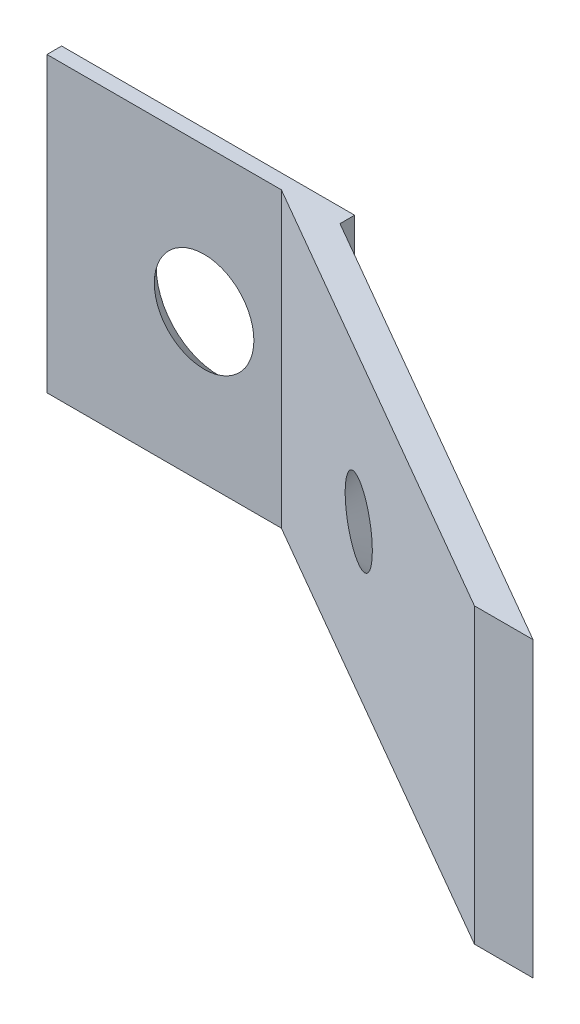
ISO-10303-21;
HEADER;
FILE_DESCRIPTION(('STEP AP214'),'2;1');
FILE_NAME('part.step','',(''),(''),'','','');
FILE_SCHEMA(('AUTOMOTIVE_DESIGN { 1 0 10303 214 1 1 1 1 }'));
ENDSEC;
DATA;
#1=APPLICATION_CONTEXT('core data for automotive mechanical design processes');
#2=APPLICATION_PROTOCOL_DEFINITION('international standard','automotive_design',2000,#1);
#3=PRODUCT_CONTEXT('',#1,'mechanical');
#4=PRODUCT('Part','Part','',(#3));
#5=PRODUCT_RELATED_PRODUCT_CATEGORY('part','',(#4));
#6=PRODUCT_DEFINITION_FORMATION('','',#4);
#7=PRODUCT_DEFINITION_CONTEXT('part definition',#1,'design');
#8=PRODUCT_DEFINITION('design','',#6,#7);
#9=PRODUCT_DEFINITION_SHAPE('','',#8);
#10=(LENGTH_UNIT() NAMED_UNIT(*) SI_UNIT(.MILLI.,.METRE.));
#11=(NAMED_UNIT(*) PLANE_ANGLE_UNIT() SI_UNIT($,.RADIAN.));
#12=(NAMED_UNIT(*) SI_UNIT($,.STERADIAN.) SOLID_ANGLE_UNIT());
#13=UNCERTAINTY_MEASURE_WITH_UNIT(LENGTH_MEASURE(1.E-05),#10,'distance_accuracy_value','');
#14=(GEOMETRIC_REPRESENTATION_CONTEXT(3) GLOBAL_UNCERTAINTY_ASSIGNED_CONTEXT((#13)) GLOBAL_UNIT_ASSIGNED_CONTEXT((#10,
#11,#12)) REPRESENTATION_CONTEXT('',''));
#15=CARTESIAN_POINT('',(0.,0.,0.));
#16=DIRECTION('',(0.,0.,1.));
#17=DIRECTION('',(1.,0.,0.));
#18=AXIS2_PLACEMENT_3D('',#15,#16,#17);
#19=CARTESIAN_POINT('',(0.,0.,0.5));
#20=DIRECTION('',(1.,0.,0.));
#21=DIRECTION('',(0.,1.,0.));
#22=AXIS2_PLACEMENT_3D('',#19,#20,#21);
#23=PLANE('',#22);
#24=DIRECTION('',(0.,-1.,0.));
#25=VECTOR('',#24,1.);
#26=CARTESIAN_POINT('',(0.,0.,0.));
#27=LINE('',#26,#25);
#28=CARTESIAN_POINT('',(0.,0.,0.));
#29=VERTEX_POINT('',#28);
#30=CARTESIAN_POINT('',(0.,-10.,0.));
#31=VERTEX_POINT('',#30);
#32=EDGE_CURVE('E152',#29,#31,#27,.T.);
#33=ORIENTED_EDGE('',*,*,#32,.T.);
#34=DIRECTION('',(0.,0.,-1.));
#35=VECTOR('',#34,1.);
#36=CARTESIAN_POINT('',(0.,-10.,0.5));
#37=LINE('',#36,#35);
#38=CARTESIAN_POINT('',(0.,-10.,0.5));
#39=VERTEX_POINT('',#38);
#40=EDGE_CURVE('E11',#39,#31,#37,.T.);
#41=ORIENTED_EDGE('',*,*,#40,.F.);
#42=DIRECTION('',(0.,-1.,0.));
#43=VECTOR('',#42,1.);
#44=CARTESIAN_POINT('',(0.,0.,0.5));
#45=LINE('',#44,#43);
#46=CARTESIAN_POINT('',(0.,0.,0.5));
#47=VERTEX_POINT('',#46);
#48=EDGE_CURVE('E155',#47,#39,#45,.T.);
#49=ORIENTED_EDGE('',*,*,#48,.F.);
#50=DIRECTION('',(0.,0.,-1.));
#51=VECTOR('',#50,1.);
#52=CARTESIAN_POINT('',(0.,0.,0.5));
#53=LINE('',#52,#51);
#54=EDGE_CURVE('E164',#47,#29,#53,.T.);
#55=ORIENTED_EDGE('',*,*,#54,.T.);
#56=EDGE_LOOP('',(#33,#41,#49,#55));
#57=FACE_BOUND('',#56,.T.);
#58=ADVANCED_FACE('F43',(#57),#23,.F.);
#59=CARTESIAN_POINT('',(0.,-10.,0.5));
#60=DIRECTION('',(0.,1.,0.));
#61=DIRECTION('',(0.,0.,1.));
#62=AXIS2_PLACEMENT_3D('',#59,#60,#61);
#63=PLANE('',#62);
#64=DIRECTION('',(1.,0.,0.));
#65=VECTOR('',#64,1.);
#66=CARTESIAN_POINT('',(0.,-10.,0.));
#67=LINE('',#66,#65);
#68=CARTESIAN_POINT('',(10.,-10.,0.));
#69=VERTEX_POINT('',#68);
#70=EDGE_CURVE('E168',#31,#69,#67,.T.);
#71=ORIENTED_EDGE('',*,*,#70,.T.);
#72=DIRECTION('',(0.,0.,-1.));
#73=VECTOR('',#72,1.);
#74=CARTESIAN_POINT('',(10.,-10.,0.5));
#75=LINE('',#74,#73);
#76=CARTESIAN_POINT('',(10.,-10.,0.5));
#77=VERTEX_POINT('',#76);
#78=EDGE_CURVE('E51',#77,#69,#75,.T.);
#79=ORIENTED_EDGE('',*,*,#78,.F.);
#80=DIRECTION('',(0.866025403784437,0.,0.500000000000002));
#81=VECTOR('',#80,1.);
#82=CARTESIAN_POINT('',(25.5884572681199,-10.,9.50000000000002));
#83=LINE('',#82,#81);
#84=CARTESIAN_POINT('',(25.5884572681199,-10.,9.50000000000002));
#85=VERTEX_POINT('',#84);
#86=EDGE_CURVE('E145',#77,#85,#83,.T.);
#87=ORIENTED_EDGE('',*,*,#86,.T.);
#88=DIRECTION('',(-1.,0.,0.));
#89=VECTOR('',#88,1.);
#90=CARTESIAN_POINT('',(23.5884572681199,-10.,9.50000000000002));
#91=LINE('',#90,#89);
#92=CARTESIAN_POINT('',(23.5884572681199,-10.,9.50000000000002));
#93=VERTEX_POINT('',#92);
#94=EDGE_CURVE('E115',#85,#93,#91,.T.);
#95=ORIENTED_EDGE('',*,*,#94,.T.);
#96=DIRECTION('',(-0.866025403784438,0.,-0.500000000000001));
#97=VECTOR('',#96,1.);
#98=CARTESIAN_POINT('',(8.00000000000001,-10.,0.5));
#99=LINE('',#98,#97);
#100=CARTESIAN_POINT('',(8.00000000000001,-10.,0.5));
#101=VERTEX_POINT('',#100);
#102=EDGE_CURVE('E135',#93,#101,#99,.T.);
#103=ORIENTED_EDGE('',*,*,#102,.T.);
#104=DIRECTION('',(1.,0.,0.));
#105=VECTOR('',#104,1.);
#106=CARTESIAN_POINT('',(0.,-10.,0.5));
#107=LINE('',#106,#105);
#108=EDGE_CURVE('E91',#39,#101,#107,.T.);
#109=ORIENTED_EDGE('',*,*,#108,.F.);
#110=ORIENTED_EDGE('',*,*,#40,.T.);
#111=EDGE_LOOP('',(#71,#79,#87,#95,#103,#109,#110));
#112=FACE_BOUND('',#111,.T.);
#113=ADVANCED_FACE('F194',(#112),#63,.F.);
#114=CARTESIAN_POINT('',(10.,0.,0.5));
#115=DIRECTION('',(-1.,0.,0.));
#116=DIRECTION('',(0.,-1.,0.));
#117=AXIS2_PLACEMENT_3D('',#114,#115,#116);
#118=PLANE('',#117);
#119=DIRECTION('',(0.,1.,0.));
#120=VECTOR('',#119,1.);
#121=CARTESIAN_POINT('',(10.,0.,0.));
#122=LINE('',#121,#120);
#123=CARTESIAN_POINT('',(10.,0.,0.));
#124=VERTEX_POINT('',#123);
#125=EDGE_CURVE('E171',#69,#124,#122,.T.);
#126=ORIENTED_EDGE('',*,*,#125,.T.);
#127=DIRECTION('',(0.,0.,-1.));
#128=VECTOR('',#127,1.);
#129=CARTESIAN_POINT('',(10.,0.,0.5));
#130=LINE('',#129,#128);
#131=CARTESIAN_POINT('',(10.,0.,0.5));
#132=VERTEX_POINT('',#131);
#133=EDGE_CURVE('E178',#132,#124,#130,.T.);
#134=ORIENTED_EDGE('',*,*,#133,.F.);
#135=DIRECTION('',(0.,1.,0.));
#136=VECTOR('',#135,1.);
#137=CARTESIAN_POINT('',(10.,0.,0.5));
#138=LINE('',#137,#136);
#139=EDGE_CURVE('E133',#77,#132,#138,.T.);
#140=ORIENTED_EDGE('',*,*,#139,.F.);
#141=ORIENTED_EDGE('',*,*,#78,.T.);
#142=EDGE_LOOP('',(#126,#134,#140,#141));
#143=FACE_BOUND('',#142,.T.);
#144=ADVANCED_FACE('F184',(#143),#118,.F.);
#145=CARTESIAN_POINT('',(0.,0.,0.5));
#146=DIRECTION('',(0.,-1.,0.));
#147=DIRECTION('',(0.,0.,-1.));
#148=AXIS2_PLACEMENT_3D('',#145,#146,#147);
#149=PLANE('',#148);
#150=DIRECTION('',(-1.,0.,0.));
#151=VECTOR('',#150,1.);
#152=CARTESIAN_POINT('',(0.,0.,0.));
#153=LINE('',#152,#151);
#154=EDGE_CURVE('E85',#124,#29,#153,.T.);
#155=ORIENTED_EDGE('',*,*,#154,.T.);
#156=ORIENTED_EDGE('',*,*,#54,.F.);
#157=DIRECTION('',(-1.,0.,0.));
#158=VECTOR('',#157,1.);
#159=CARTESIAN_POINT('',(0.,0.,0.5));
#160=LINE('',#159,#158);
#161=CARTESIAN_POINT('',(8.00000000000001,0.,0.5));
#162=VERTEX_POINT('',#161);
#163=EDGE_CURVE('E63',#162,#47,#160,.T.);
#164=ORIENTED_EDGE('',*,*,#163,.F.);
#165=DIRECTION('',(-0.866025403784438,0.,-0.500000000000001));
#166=VECTOR('',#165,1.);
#167=CARTESIAN_POINT('',(8.00000000000001,0.,0.5));
#168=LINE('',#167,#166);
#169=CARTESIAN_POINT('',(23.5884572681199,0.,9.50000000000002));
#170=VERTEX_POINT('',#169);
#171=EDGE_CURVE('E122',#170,#162,#168,.T.);
#172=ORIENTED_EDGE('',*,*,#171,.F.);
#173=DIRECTION('',(-1.,0.,0.));
#174=VECTOR('',#173,1.);
#175=CARTESIAN_POINT('',(23.5884572681199,0.,9.50000000000002));
#176=LINE('',#175,#174);
#177=CARTESIAN_POINT('',(25.5884572681199,0.,9.50000000000002));
#178=VERTEX_POINT('',#177);
#179=EDGE_CURVE('E112',#178,#170,#176,.T.);
#180=ORIENTED_EDGE('',*,*,#179,.F.);
#181=DIRECTION('',(0.866025403784437,0.,0.500000000000002));
#182=VECTOR('',#181,1.);
#183=CARTESIAN_POINT('',(25.5884572681199,0.,9.50000000000002));
#184=LINE('',#183,#182);
#185=EDGE_CURVE('E126',#132,#178,#184,.T.);
#186=ORIENTED_EDGE('',*,*,#185,.F.);
#187=ORIENTED_EDGE('',*,*,#133,.T.);
#188=EDGE_LOOP('',(#155,#156,#164,#172,#180,#186,#187));
#189=FACE_BOUND('',#188,.T.);
#190=ADVANCED_FACE('F125',(#189),#149,.F.);
#191=CARTESIAN_POINT('',(0.,0.,0.5));
#192=DIRECTION('',(0.,0.,1.));
#193=DIRECTION('',(1.,0.,0.));
#194=AXIS2_PLACEMENT_3D('',#191,#192,#193);
#195=PLANE('',#194);
#196=CARTESIAN_POINT('',(5.3625164013596,-4.92129239402616,0.5));
#197=DIRECTION('',(0.,0.,1.));
#198=DIRECTION('',(1.,0.,0.));
#199=AXIS2_PLACEMENT_3D('',#196,#197,#198);
#200=CIRCLE('',#199,1.69895663109189);
#201=CARTESIAN_POINT('',(7.06147303245148,-4.92129239402616,0.5));
#202=VERTEX_POINT('',#201);
#203=EDGE_CURVE('E140',#202,#202,#200,.T.);
#204=ORIENTED_EDGE('',*,*,#203,.F.);
#205=EDGE_LOOP('',(#204));
#206=FACE_BOUND('',#205,.T.);
#207=DIRECTION('',(0.,-1.,0.));
#208=VECTOR('',#207,1.);
#209=CARTESIAN_POINT('',(8.00000000000001,0.,0.5));
#210=LINE('',#209,#208);
#211=EDGE_CURVE('E58',#162,#101,#210,.T.);
#212=ORIENTED_EDGE('',*,*,#211,.F.);
#213=ORIENTED_EDGE('',*,*,#163,.T.);
#214=ORIENTED_EDGE('',*,*,#48,.T.);
#215=ORIENTED_EDGE('',*,*,#108,.T.);
#216=EDGE_LOOP('',(#212,#213,#214,#215));
#217=FACE_BOUND('',#216,.T.);
#218=ADVANCED_FACE('F204',(#206,#217),#195,.T.);
#219=CARTESIAN_POINT('',(0.,0.,0.));
#220=DIRECTION('',(0.,0.,1.));
#221=DIRECTION('',(1.,0.,0.));
#222=AXIS2_PLACEMENT_3D('',#219,#220,#221);
#223=PLANE('',#222);
#224=CARTESIAN_POINT('',(5.3625164013596,-4.92129239402616,0.));
#225=DIRECTION('',(0.,0.,-1.));
#226=DIRECTION('',(-1.,0.,0.));
#227=AXIS2_PLACEMENT_3D('',#224,#225,#226);
#228=CIRCLE('',#227,2.1336);
#229=CARTESIAN_POINT('',(3.2289164013596,-4.92129239402616,0.));
#230=VERTEX_POINT('',#229);
#231=EDGE_CURVE('E238',#230,#230,#228,.T.);
#232=ORIENTED_EDGE('',*,*,#231,.F.);
#233=EDGE_LOOP('',(#232));
#234=FACE_BOUND('',#233,.T.);
#235=ORIENTED_EDGE('',*,*,#32,.F.);
#236=ORIENTED_EDGE('',*,*,#154,.F.);
#237=ORIENTED_EDGE('',*,*,#125,.F.);
#238=ORIENTED_EDGE('',*,*,#70,.F.);
#239=EDGE_LOOP('',(#235,#236,#237,#238));
#240=FACE_BOUND('',#239,.T.);
#241=ADVANCED_FACE('F187',(#234,#240),#223,.F.);
#242=CARTESIAN_POINT('',(8.00000000000001,0.,0.5));
#243=DIRECTION('',(-0.500000000000001,0.,0.866025403784438));
#244=DIRECTION('',(0.866025403784438,0.,0.500000000000001));
#245=AXIS2_PLACEMENT_3D('',#242,#243,#244);
#246=PLANE('',#245);
#247=CARTESIAN_POINT('',(14.2468704568857,-4.87940747069672,4.10663233987571));
#248=DIRECTION('',(-0.500000000000001,0.,0.866025403784438));
#249=DIRECTION('',(0.866025403784438,0.,0.500000000000001));
#250=AXIS2_PLACEMENT_3D('',#247,#248,#249);
#251=CIRCLE('',#250,1.26431326218376);
#252=CARTESIAN_POINT('',(15.3417978602785,-4.87940747069672,4.7387889709676));
#253=VERTEX_POINT('',#252);
#254=EDGE_CURVE('E231',#253,#253,#251,.T.);
#255=ORIENTED_EDGE('',*,*,#254,.F.);
#256=EDGE_LOOP('',(#255));
#257=FACE_BOUND('',#256,.T.);
#258=ORIENTED_EDGE('',*,*,#102,.F.);
#259=DIRECTION('',(0.,-1.,0.));
#260=VECTOR('',#259,1.);
#261=CARTESIAN_POINT('',(23.5884572681199,0.,9.50000000000002));
#262=LINE('',#261,#260);
#263=EDGE_CURVE('E121',#170,#93,#262,.T.);
#264=ORIENTED_EDGE('',*,*,#263,.F.);
#265=ORIENTED_EDGE('',*,*,#171,.T.);
#266=ORIENTED_EDGE('',*,*,#211,.T.);
#267=EDGE_LOOP('',(#258,#264,#265,#266));
#268=FACE_BOUND('',#267,.T.);
#269=ADVANCED_FACE('F193',(#257,#268),#246,.T.);
#270=CARTESIAN_POINT('',(23.5884572681199,0.,9.50000000000002));
#271=DIRECTION('',(0.,0.,1.));
#272=DIRECTION('',(1.,0.,0.));
#273=AXIS2_PLACEMENT_3D('',#270,#271,#272);
#274=PLANE('',#273);
#275=ORIENTED_EDGE('',*,*,#94,.F.);
#276=DIRECTION('',(0.,-1.,0.));
#277=VECTOR('',#276,1.);
#278=CARTESIAN_POINT('',(25.5884572681199,0.,9.50000000000002));
#279=LINE('',#278,#277);
#280=EDGE_CURVE('E109',#178,#85,#279,.T.);
#281=ORIENTED_EDGE('',*,*,#280,.F.);
#282=ORIENTED_EDGE('',*,*,#179,.T.);
#283=ORIENTED_EDGE('',*,*,#263,.T.);
#284=EDGE_LOOP('',(#275,#281,#282,#283));
#285=FACE_BOUND('',#284,.T.);
#286=ADVANCED_FACE('F111',(#285),#274,.T.);
#287=CARTESIAN_POINT('',(25.5884572681199,0.,9.50000000000002));
#288=DIRECTION('',(0.500000000000002,0.,-0.866025403784438));
#289=DIRECTION('',(-0.866025403784438,0.,-0.500000000000002));
#290=AXIS2_PLACEMENT_3D('',#287,#288,#289);
#291=PLANE('',#290);
#292=CARTESIAN_POINT('',(14.7468704568857,-4.87940747069672,3.24060693609127));
#293=DIRECTION('',(0.500000000000002,0.,-0.866025403784438));
#294=DIRECTION('',(-0.866025403784438,0.,-0.500000000000002));
#295=AXIS2_PLACEMENT_3D('',#292,#293,#294);
#296=CIRCLE('',#295,2.1336);
#297=CARTESIAN_POINT('',(12.8991186553713,-4.87940747069672,2.17380693609127));
#298=VERTEX_POINT('',#297);
#299=EDGE_CURVE('E234',#298,#298,#296,.T.);
#300=ORIENTED_EDGE('',*,*,#299,.F.);
#301=EDGE_LOOP('',(#300));
#302=FACE_BOUND('',#301,.T.);
#303=ORIENTED_EDGE('',*,*,#86,.F.);
#304=ORIENTED_EDGE('',*,*,#139,.T.);
#305=ORIENTED_EDGE('',*,*,#185,.T.);
#306=ORIENTED_EDGE('',*,*,#280,.T.);
#307=EDGE_LOOP('',(#303,#304,#305,#306));
#308=FACE_BOUND('',#307,.T.);
#309=ADVANCED_FACE('F131',(#302,#308),#291,.T.);
#310=CARTESIAN_POINT('',(5.3625164013596,-4.92129239402616,0.));
#311=DIRECTION('',(0.,0.,-1.));
#312=DIRECTION('',(-1.,0.,0.));
#313=AXIS2_PLACEMENT_3D('',#310,#311,#312);
#314=CONICAL_SURFACE('',#313,2.1336,0.715584993317674);
#315=ORIENTED_EDGE('',*,*,#203,.T.);
#316=EDGE_LOOP('',(#315));
#317=FACE_BOUND('',#316,.T.);
#318=ORIENTED_EDGE('',*,*,#231,.T.);
#319=EDGE_LOOP('',(#318));
#320=FACE_BOUND('',#319,.T.);
#321=ADVANCED_FACE('F213',(#317,#320),#314,.F.);
#322=CARTESIAN_POINT('',(14.7468704568857,-4.87940747069672,3.24060693609127));
#323=DIRECTION('',(0.500000000000002,0.,-0.866025403784438));
#324=DIRECTION('',(-0.866025403784438,0.,-0.500000000000002));
#325=AXIS2_PLACEMENT_3D('',#322,#323,#324);
#326=CONICAL_SURFACE('',#325,2.1336,0.715584993317679);
#327=ORIENTED_EDGE('',*,*,#254,.T.);
#328=EDGE_LOOP('',(#327));
#329=FACE_BOUND('',#328,.T.);
#330=ORIENTED_EDGE('',*,*,#299,.T.);
#331=EDGE_LOOP('',(#330));
#332=FACE_BOUND('',#331,.T.);
#333=ADVANCED_FACE('F222',(#329,#332),#326,.F.);
#334=CLOSED_SHELL('',(#58,#113,#144,#190,#218,#241,#269,#286,#309,#321,#333));
#335=MANIFOLD_SOLID_BREP('B2',#334);
#336=ADVANCED_BREP_SHAPE_REPRESENTATION('',(#18,#335),#14);
#337=SHAPE_DEFINITION_REPRESENTATION(#9,#336);
ENDSEC;
END-ISO-10303-21;
